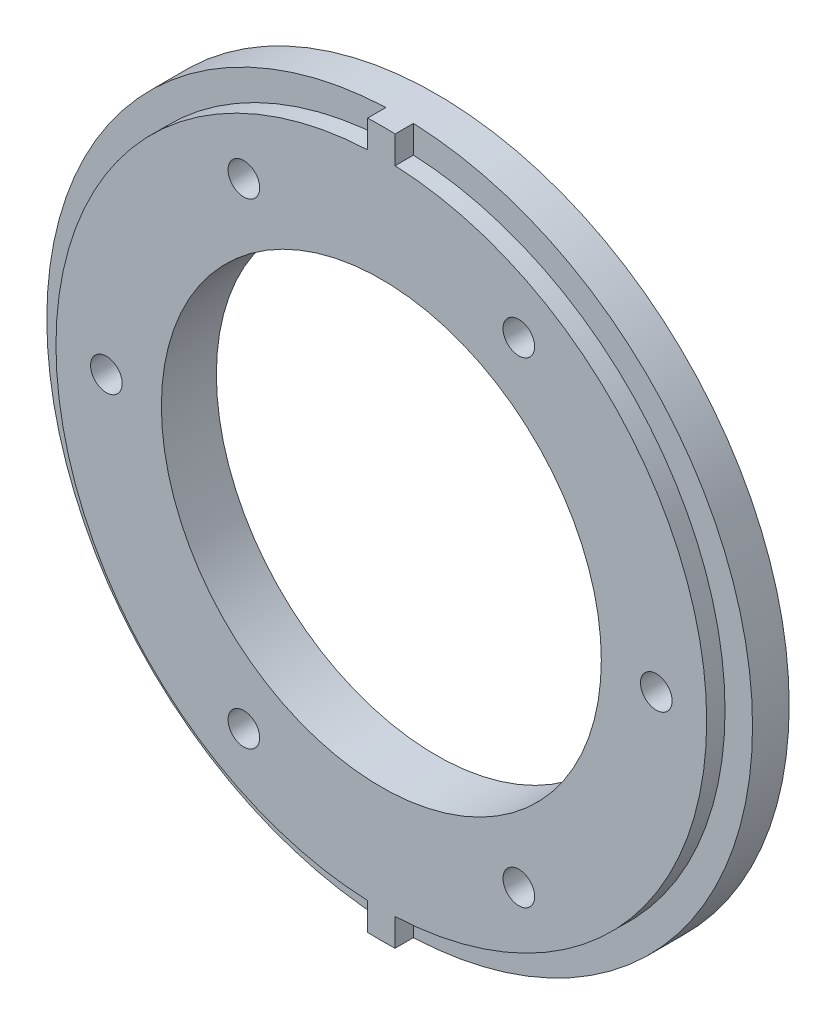
ISO-10303-21;
HEADER;
FILE_DESCRIPTION(('STEP AP214'),'2;1');
FILE_NAME('part.step','',(''),(''),'','','');
FILE_SCHEMA(('AUTOMOTIVE_DESIGN { 1 0 10303 214 1 1 1 1 }'));
ENDSEC;
DATA;
#1=APPLICATION_CONTEXT('core data for automotive mechanical design processes');
#2=APPLICATION_PROTOCOL_DEFINITION('international standard','automotive_design',2000,#1);
#3=PRODUCT_CONTEXT('',#1,'mechanical');
#4=PRODUCT('Part','Part','',(#3));
#5=PRODUCT_RELATED_PRODUCT_CATEGORY('part','',(#4));
#6=PRODUCT_DEFINITION_FORMATION('','',#4);
#7=PRODUCT_DEFINITION_CONTEXT('part definition',#1,'design');
#8=PRODUCT_DEFINITION('design','',#6,#7);
#9=PRODUCT_DEFINITION_SHAPE('','',#8);
#10=(LENGTH_UNIT() NAMED_UNIT(*) SI_UNIT(.MILLI.,.METRE.));
#11=(NAMED_UNIT(*) PLANE_ANGLE_UNIT() SI_UNIT($,.RADIAN.));
#12=(NAMED_UNIT(*) SI_UNIT($,.STERADIAN.) SOLID_ANGLE_UNIT());
#13=UNCERTAINTY_MEASURE_WITH_UNIT(LENGTH_MEASURE(1.E-05),#10,'distance_accuracy_value','');
#14=(GEOMETRIC_REPRESENTATION_CONTEXT(3) GLOBAL_UNCERTAINTY_ASSIGNED_CONTEXT((#13)) GLOBAL_UNIT_ASSIGNED_CONTEXT((#10,
#11,#12)) REPRESENTATION_CONTEXT('',''));
#15=CARTESIAN_POINT('',(0.,0.,0.));
#16=DIRECTION('',(0.,0.,1.));
#17=DIRECTION('',(1.,0.,0.));
#18=AXIS2_PLACEMENT_3D('',#15,#16,#17);
#19=CARTESIAN_POINT('',(0.,0.,4.));
#20=DIRECTION('',(0.,0.,1.));
#21=DIRECTION('',(1.,0.,0.));
#22=AXIS2_PLACEMENT_3D('',#19,#20,#21);
#23=PLANE('',#22);
#24=DIRECTION('',(0.,-1.,0.));
#25=VECTOR('',#24,1.);
#26=CARTESIAN_POINT('',(-1.50000000000178,-38.4707681233426,4.));
#27=LINE('',#26,#25);
#28=CARTESIAN_POINT('',(-1.50000000000178,-35.4682957019363,4.));
#29=VERTEX_POINT('',#28);
#30=CARTESIAN_POINT('',(-1.50000000000178,-38.4707681233426,4.));
#31=VERTEX_POINT('',#30);
#32=EDGE_CURVE('E48',#29,#31,#27,.T.);
#33=ORIENTED_EDGE('',*,*,#32,.F.);
#34=CARTESIAN_POINT('',(0.,0.,4.));
#35=DIRECTION('',(0.,0.,1.));
#36=DIRECTION('',(1.,0.,0.));
#37=AXIS2_PLACEMENT_3D('',#34,#35,#36);
#38=CIRCLE('',#37,35.5);
#39=CARTESIAN_POINT('',(-1.50000000000178,35.4682957019363,4.));
#40=VERTEX_POINT('',#39);
#41=EDGE_CURVE('E52',#40,#29,#38,.T.);
#42=ORIENTED_EDGE('',*,*,#41,.F.);
#43=DIRECTION('',(0.,-1.,0.));
#44=VECTOR('',#43,1.);
#45=CARTESIAN_POINT('',(-1.50000000000178,38.4707681233426,4.));
#46=LINE('',#45,#44);
#47=CARTESIAN_POINT('',(-1.50000000000178,38.4707681233426,4.));
#48=VERTEX_POINT('',#47);
#49=EDGE_CURVE('E205',#48,#40,#46,.T.);
#50=ORIENTED_EDGE('',*,*,#49,.F.);
#51=CARTESIAN_POINT('',(0.,0.,4.));
#52=DIRECTION('',(0.,0.,1.));
#53=DIRECTION('',(1.,0.,0.));
#54=AXIS2_PLACEMENT_3D('',#51,#52,#53);
#55=CIRCLE('',#54,38.5);
#56=EDGE_CURVE('E11',#48,#31,#55,.T.);
#57=ORIENTED_EDGE('',*,*,#56,.T.);
#58=EDGE_LOOP('',(#33,#42,#50,#57));
#59=FACE_BOUND('',#58,.T.);
#60=ADVANCED_FACE('F32',(#59),#23,.T.);
#61=DIRECTION('',(0.,1.,0.));
#62=VECTOR('',#61,1.);
#63=CARTESIAN_POINT('',(1.49999999999822,38.4707681233428,4.));
#64=LINE('',#63,#62);
#65=CARTESIAN_POINT('',(1.49999999999822,35.4682957019364,4.));
#66=VERTEX_POINT('',#65);
#67=CARTESIAN_POINT('',(1.49999999999822,38.4707681233427,4.));
#68=VERTEX_POINT('',#67);
#69=EDGE_CURVE('E180',#66,#68,#64,.T.);
#70=ORIENTED_EDGE('',*,*,#69,.F.);
#71=CARTESIAN_POINT('',(0.,0.,4.));
#72=DIRECTION('',(0.,0.,1.));
#73=DIRECTION('',(1.,0.,0.));
#74=AXIS2_PLACEMENT_3D('',#71,#72,#73);
#75=CIRCLE('',#74,35.5);
#76=CARTESIAN_POINT('',(1.49999999999822,-35.4682957019364,4.));
#77=VERTEX_POINT('',#76);
#78=EDGE_CURVE('E177',#77,#66,#75,.T.);
#79=ORIENTED_EDGE('',*,*,#78,.F.);
#80=DIRECTION('',(0.,1.,0.));
#81=VECTOR('',#80,1.);
#82=CARTESIAN_POINT('',(1.49999999999822,-38.4707681233428,4.));
#83=LINE('',#82,#81);
#84=CARTESIAN_POINT('',(1.49999999999822,-38.4707681233427,4.));
#85=VERTEX_POINT('',#84);
#86=EDGE_CURVE('E176',#85,#77,#83,.T.);
#87=ORIENTED_EDGE('',*,*,#86,.F.);
#88=EDGE_CURVE('E41',#85,#68,#55,.T.);
#89=ORIENTED_EDGE('',*,*,#88,.T.);
#90=EDGE_LOOP('',(#70,#79,#87,#89));
#91=FACE_BOUND('',#90,.T.);
#92=ADVANCED_FACE('F226',(#91),#23,.T.);
#93=CARTESIAN_POINT('',(0.,0.,0.));
#94=DIRECTION('',(0.,0.,1.));
#95=DIRECTION('',(1.,0.,0.));
#96=AXIS2_PLACEMENT_3D('',#93,#94,#95);
#97=PLANE('',#96);
#98=CARTESIAN_POINT('',(-14.9999999999948,25.9807621135328,0.));
#99=DIRECTION('',(0.,0.,1.));
#100=DIRECTION('',(1.,0.,0.));
#101=AXIS2_PLACEMENT_3D('',#98,#99,#100);
#102=CIRCLE('',#101,1.725);
#103=CARTESIAN_POINT('',(-13.2749999999948,25.9807621135328,0.));
#104=VERTEX_POINT('',#103);
#105=EDGE_CURVE('E125',#104,#104,#102,.T.);
#106=ORIENTED_EDGE('',*,*,#105,.T.);
#107=EDGE_LOOP('',(#106));
#108=FACE_BOUND('',#107,.T.);
#109=CARTESIAN_POINT('',(29.9999999999971,0.,0.));
#110=DIRECTION('',(0.,0.,1.));
#111=DIRECTION('',(1.,0.,0.));
#112=AXIS2_PLACEMENT_3D('',#109,#110,#111);
#113=CIRCLE('',#112,1.725);
#114=CARTESIAN_POINT('',(31.7249999999971,0.,0.));
#115=VERTEX_POINT('',#114);
#116=EDGE_CURVE('E158',#115,#115,#113,.T.);
#117=ORIENTED_EDGE('',*,*,#116,.T.);
#118=EDGE_LOOP('',(#117));
#119=FACE_BOUND('',#118,.T.);
#120=CARTESIAN_POINT('',(14.9999999999948,25.9807621135328,0.));
#121=DIRECTION('',(0.,0.,1.));
#122=DIRECTION('',(-1.,0.,0.));
#123=AXIS2_PLACEMENT_3D('',#120,#121,#122);
#124=CIRCLE('',#123,1.725);
#125=CARTESIAN_POINT('',(13.2749999999948,25.9807621135328,0.));
#126=VERTEX_POINT('',#125);
#127=EDGE_CURVE('E164',#126,#126,#124,.T.);
#128=ORIENTED_EDGE('',*,*,#127,.T.);
#129=EDGE_LOOP('',(#128));
#130=FACE_BOUND('',#129,.T.);
#131=CARTESIAN_POINT('',(0.,0.,0.));
#132=DIRECTION('',(0.,0.,1.));
#133=DIRECTION('',(1.,0.,0.));
#134=AXIS2_PLACEMENT_3D('',#131,#132,#133);
#135=CIRCLE('',#134,38.5);
#136=CARTESIAN_POINT('',(38.5,0.,0.));
#137=VERTEX_POINT('',#136);
#138=EDGE_CURVE('E170',#137,#137,#135,.T.);
#139=ORIENTED_EDGE('',*,*,#138,.F.);
#140=EDGE_LOOP('',(#139));
#141=FACE_BOUND('',#140,.T.);
#142=CARTESIAN_POINT('',(14.9999999999948,-25.9807621135328,0.));
#143=DIRECTION('',(0.,0.,1.));
#144=DIRECTION('',(-1.,0.,0.));
#145=AXIS2_PLACEMENT_3D('',#142,#143,#144);
#146=CIRCLE('',#145,1.725);
#147=CARTESIAN_POINT('',(13.2749999999948,-25.9807621135328,0.));
#148=VERTEX_POINT('',#147);
#149=EDGE_CURVE('E167',#148,#148,#146,.T.);
#150=ORIENTED_EDGE('',*,*,#149,.T.);
#151=EDGE_LOOP('',(#150));
#152=FACE_BOUND('',#151,.T.);
#153=CARTESIAN_POINT('',(-29.9999999999971,0.,0.));
#154=DIRECTION('',(0.,0.,1.));
#155=DIRECTION('',(1.,0.,0.));
#156=AXIS2_PLACEMENT_3D('',#153,#154,#155);
#157=CIRCLE('',#156,1.725);
#158=CARTESIAN_POINT('',(-28.2749999999971,0.,0.));
#159=VERTEX_POINT('',#158);
#160=EDGE_CURVE('E161',#159,#159,#157,.T.);
#161=ORIENTED_EDGE('',*,*,#160,.T.);
#162=EDGE_LOOP('',(#161));
#163=FACE_BOUND('',#162,.T.);
#164=CARTESIAN_POINT('',(-14.9999999999948,-25.9807621135328,0.));
#165=DIRECTION('',(0.,0.,1.));
#166=DIRECTION('',(1.,0.,0.));
#167=AXIS2_PLACEMENT_3D('',#164,#165,#166);
#168=CIRCLE('',#167,1.725);
#169=CARTESIAN_POINT('',(-13.2749999999948,-25.9807621135328,0.));
#170=VERTEX_POINT('',#169);
#171=EDGE_CURVE('E155',#170,#170,#168,.T.);
#172=ORIENTED_EDGE('',*,*,#171,.T.);
#173=EDGE_LOOP('',(#172));
#174=FACE_BOUND('',#173,.T.);
#175=CARTESIAN_POINT('',(0.,0.,0.));
#176=DIRECTION('',(0.,0.,1.));
#177=DIRECTION('',(1.,0.,0.));
#178=AXIS2_PLACEMENT_3D('',#175,#176,#177);
#179=CIRCLE('',#178,24.);
#180=CARTESIAN_POINT('',(24.,0.,0.));
#181=VERTEX_POINT('',#180);
#182=EDGE_CURVE('E122',#181,#181,#179,.T.);
#183=ORIENTED_EDGE('',*,*,#182,.T.);
#184=EDGE_LOOP('',(#183));
#185=FACE_BOUND('',#184,.T.);
#186=ADVANCED_FACE('F231',(#108,#119,#130,#141,#152,#163,#174,#185),#97,.F.);
#187=CARTESIAN_POINT('',(0.,0.,4.));
#188=DIRECTION('',(0.,0.,-1.));
#189=DIRECTION('',(-1.,0.,0.));
#190=AXIS2_PLACEMENT_3D('',#187,#188,#189);
#191=CYLINDRICAL_SURFACE('',#190,38.5);
#192=ORIENTED_EDGE('',*,*,#56,.F.);
#193=DIRECTION('',(0.,0.,-1.));
#194=VECTOR('',#193,1.);
#195=CARTESIAN_POINT('',(-1.50000000000178,38.4707681233426,6.));
#196=LINE('',#195,#194);
#197=CARTESIAN_POINT('',(-1.50000000000178,38.4707681233426,6.));
#198=VERTEX_POINT('',#197);
#199=EDGE_CURVE('E149',#198,#48,#196,.T.);
#200=ORIENTED_EDGE('',*,*,#199,.F.);
#201=CARTESIAN_POINT('',(0.,0.,6.));
#202=DIRECTION('',(0.,0.,1.));
#203=DIRECTION('',(1.,0.,0.));
#204=AXIS2_PLACEMENT_3D('',#201,#202,#203);
#205=CIRCLE('',#204,38.5);
#206=CARTESIAN_POINT('',(1.49999999999822,38.4707681233428,6.));
#207=VERTEX_POINT('',#206);
#208=EDGE_CURVE('E195',#207,#198,#205,.T.);
#209=ORIENTED_EDGE('',*,*,#208,.F.);
#210=DIRECTION('',(0.,0.,-1.));
#211=VECTOR('',#210,1.);
#212=CARTESIAN_POINT('',(1.49999999999822,38.4707681233428,6.));
#213=LINE('',#212,#211);
#214=EDGE_CURVE('E151',#207,#68,#213,.T.);
#215=ORIENTED_EDGE('',*,*,#214,.T.);
#216=ORIENTED_EDGE('',*,*,#88,.F.);
#217=DIRECTION('',(0.,0.,-1.));
#218=VECTOR('',#217,1.);
#219=CARTESIAN_POINT('',(1.49999999999822,-38.4707681233428,6.));
#220=LINE('',#219,#218);
#221=CARTESIAN_POINT('',(1.49999999999822,-38.4707681233428,6.));
#222=VERTEX_POINT('',#221);
#223=EDGE_CURVE('E101',#222,#85,#220,.T.);
#224=ORIENTED_EDGE('',*,*,#223,.F.);
#225=CARTESIAN_POINT('',(0.,0.,6.));
#226=DIRECTION('',(0.,0.,1.));
#227=DIRECTION('',(-1.,0.,0.));
#228=AXIS2_PLACEMENT_3D('',#225,#226,#227);
#229=CIRCLE('',#228,38.5);
#230=CARTESIAN_POINT('',(-1.50000000000178,-38.4707681233426,6.));
#231=VERTEX_POINT('',#230);
#232=EDGE_CURVE('E107',#231,#222,#229,.T.);
#233=ORIENTED_EDGE('',*,*,#232,.F.);
#234=DIRECTION('',(0.,0.,-1.));
#235=VECTOR('',#234,1.);
#236=CARTESIAN_POINT('',(-1.50000000000178,-38.4707681233426,6.));
#237=LINE('',#236,#235);
#238=EDGE_CURVE('E137',#231,#31,#237,.T.);
#239=ORIENTED_EDGE('',*,*,#238,.T.);
#240=EDGE_LOOP('',(#192,#200,#209,#215,#216,#224,#233,#239));
#241=FACE_BOUND('',#240,.T.);
#242=ORIENTED_EDGE('',*,*,#138,.T.);
#243=EDGE_LOOP('',(#242));
#244=FACE_BOUND('',#243,.T.);
#245=ADVANCED_FACE('F34',(#241,#244),#191,.T.);
#246=CARTESIAN_POINT('',(14.9999999999948,-25.9807621135328,4.));
#247=DIRECTION('',(0.,0.,-1.));
#248=DIRECTION('',(-1.,0.,0.));
#249=AXIS2_PLACEMENT_3D('',#246,#247,#248);
#250=CYLINDRICAL_SURFACE('',#249,1.725);
#251=ORIENTED_EDGE('',*,*,#149,.F.);
#252=EDGE_LOOP('',(#251));
#253=FACE_BOUND('',#252,.T.);
#254=CARTESIAN_POINT('',(14.9999999999948,-25.9807621135328,6.));
#255=DIRECTION('',(0.,0.,1.));
#256=DIRECTION('',(1.,0.,0.));
#257=AXIS2_PLACEMENT_3D('',#254,#255,#256);
#258=CIRCLE('',#257,1.725);
#259=CARTESIAN_POINT('',(16.7249999999948,-25.9807621135328,6.));
#260=VERTEX_POINT('',#259);
#261=EDGE_CURVE('E296',#260,#260,#258,.T.);
#262=ORIENTED_EDGE('',*,*,#261,.T.);
#263=EDGE_LOOP('',(#262));
#264=FACE_BOUND('',#263,.T.);
#265=ADVANCED_FACE('F234',(#253,#264),#250,.F.);
#266=CARTESIAN_POINT('',(14.9999999999948,25.9807621135328,4.));
#267=DIRECTION('',(0.,0.,-1.));
#268=DIRECTION('',(-1.,0.,0.));
#269=AXIS2_PLACEMENT_3D('',#266,#267,#268);
#270=CYLINDRICAL_SURFACE('',#269,1.725);
#271=ORIENTED_EDGE('',*,*,#127,.F.);
#272=EDGE_LOOP('',(#271));
#273=FACE_BOUND('',#272,.T.);
#274=CARTESIAN_POINT('',(14.9999999999948,25.9807621135328,6.));
#275=DIRECTION('',(0.,0.,1.));
#276=DIRECTION('',(1.,0.,0.));
#277=AXIS2_PLACEMENT_3D('',#274,#275,#276);
#278=CIRCLE('',#277,1.725);
#279=CARTESIAN_POINT('',(16.7249999999948,25.9807621135328,6.));
#280=VERTEX_POINT('',#279);
#281=EDGE_CURVE('E188',#280,#280,#278,.T.);
#282=ORIENTED_EDGE('',*,*,#281,.T.);
#283=EDGE_LOOP('',(#282));
#284=FACE_BOUND('',#283,.T.);
#285=ADVANCED_FACE('F282',(#273,#284),#270,.F.);
#286=CARTESIAN_POINT('',(-29.9999999999971,0.,4.));
#287=DIRECTION('',(0.,0.,-1.));
#288=DIRECTION('',(-1.,0.,0.));
#289=AXIS2_PLACEMENT_3D('',#286,#287,#288);
#290=CYLINDRICAL_SURFACE('',#289,1.725);
#291=ORIENTED_EDGE('',*,*,#160,.F.);
#292=EDGE_LOOP('',(#291));
#293=FACE_BOUND('',#292,.T.);
#294=CARTESIAN_POINT('',(-29.9999999999971,0.,6.));
#295=DIRECTION('',(0.,0.,1.));
#296=DIRECTION('',(1.,0.,0.));
#297=AXIS2_PLACEMENT_3D('',#294,#295,#296);
#298=CIRCLE('',#297,1.725);
#299=CARTESIAN_POINT('',(-28.2749999999971,0.,6.));
#300=VERTEX_POINT('',#299);
#301=EDGE_CURVE('E304',#300,#300,#298,.T.);
#302=ORIENTED_EDGE('',*,*,#301,.T.);
#303=EDGE_LOOP('',(#302));
#304=FACE_BOUND('',#303,.T.);
#305=ADVANCED_FACE('F279',(#293,#304),#290,.F.);
#306=CARTESIAN_POINT('',(29.9999999999971,0.,4.));
#307=DIRECTION('',(0.,0.,-1.));
#308=DIRECTION('',(-1.,0.,0.));
#309=AXIS2_PLACEMENT_3D('',#306,#307,#308);
#310=CYLINDRICAL_SURFACE('',#309,1.725);
#311=ORIENTED_EDGE('',*,*,#116,.F.);
#312=EDGE_LOOP('',(#311));
#313=FACE_BOUND('',#312,.T.);
#314=CARTESIAN_POINT('',(29.9999999999971,0.,6.));
#315=DIRECTION('',(0.,0.,1.));
#316=DIRECTION('',(1.,0.,0.));
#317=AXIS2_PLACEMENT_3D('',#314,#315,#316);
#318=CIRCLE('',#317,1.725);
#319=CARTESIAN_POINT('',(31.7249999999971,0.,6.));
#320=VERTEX_POINT('',#319);
#321=EDGE_CURVE('E294',#320,#320,#318,.T.);
#322=ORIENTED_EDGE('',*,*,#321,.T.);
#323=EDGE_LOOP('',(#322));
#324=FACE_BOUND('',#323,.T.);
#325=ADVANCED_FACE('F275',(#313,#324),#310,.F.);
#326=CARTESIAN_POINT('',(-14.9999999999948,-25.9807621135328,4.));
#327=DIRECTION('',(0.,0.,-1.));
#328=DIRECTION('',(-1.,0.,0.));
#329=AXIS2_PLACEMENT_3D('',#326,#327,#328);
#330=CYLINDRICAL_SURFACE('',#329,1.725);
#331=ORIENTED_EDGE('',*,*,#171,.F.);
#332=EDGE_LOOP('',(#331));
#333=FACE_BOUND('',#332,.T.);
#334=CARTESIAN_POINT('',(-14.9999999999948,-25.9807621135328,6.));
#335=DIRECTION('',(0.,0.,1.));
#336=DIRECTION('',(1.,0.,0.));
#337=AXIS2_PLACEMENT_3D('',#334,#335,#336);
#338=CIRCLE('',#337,1.725);
#339=CARTESIAN_POINT('',(-13.2749999999948,-25.9807621135328,6.));
#340=VERTEX_POINT('',#339);
#341=EDGE_CURVE('E301',#340,#340,#338,.T.);
#342=ORIENTED_EDGE('',*,*,#341,.T.);
#343=EDGE_LOOP('',(#342));
#344=FACE_BOUND('',#343,.T.);
#345=ADVANCED_FACE('F267',(#333,#344),#330,.F.);
#346=CARTESIAN_POINT('',(-14.9999999999948,25.9807621135328,4.));
#347=DIRECTION('',(0.,0.,-1.));
#348=DIRECTION('',(-1.,0.,0.));
#349=AXIS2_PLACEMENT_3D('',#346,#347,#348);
#350=CYLINDRICAL_SURFACE('',#349,1.725);
#351=ORIENTED_EDGE('',*,*,#105,.F.);
#352=EDGE_LOOP('',(#351));
#353=FACE_BOUND('',#352,.T.);
#354=CARTESIAN_POINT('',(-14.9999999999948,25.9807621135328,6.));
#355=DIRECTION('',(0.,0.,1.));
#356=DIRECTION('',(1.,0.,0.));
#357=AXIS2_PLACEMENT_3D('',#354,#355,#356);
#358=CIRCLE('',#357,1.725);
#359=CARTESIAN_POINT('',(-13.2749999999948,25.9807621135328,6.));
#360=VERTEX_POINT('',#359);
#361=EDGE_CURVE('E183',#360,#360,#358,.T.);
#362=ORIENTED_EDGE('',*,*,#361,.T.);
#363=EDGE_LOOP('',(#362));
#364=FACE_BOUND('',#363,.T.);
#365=ADVANCED_FACE('F259',(#353,#364),#350,.F.);
#366=CARTESIAN_POINT('',(0.,0.,4.));
#367=DIRECTION('',(0.,0.,-1.));
#368=DIRECTION('',(-1.,0.,0.));
#369=AXIS2_PLACEMENT_3D('',#366,#367,#368);
#370=CYLINDRICAL_SURFACE('',#369,24.);
#371=ORIENTED_EDGE('',*,*,#182,.F.);
#372=EDGE_LOOP('',(#371));
#373=FACE_BOUND('',#372,.T.);
#374=CARTESIAN_POINT('',(0.,0.,6.));
#375=DIRECTION('',(0.,0.,1.));
#376=DIRECTION('',(1.,0.,0.));
#377=AXIS2_PLACEMENT_3D('',#374,#375,#376);
#378=CIRCLE('',#377,24.);
#379=CARTESIAN_POINT('',(24.,0.,6.));
#380=VERTEX_POINT('',#379);
#381=EDGE_CURVE('E178',#380,#380,#378,.T.);
#382=ORIENTED_EDGE('',*,*,#381,.T.);
#383=EDGE_LOOP('',(#382));
#384=FACE_BOUND('',#383,.T.);
#385=ADVANCED_FACE('F257',(#373,#384),#370,.F.);
#386=CARTESIAN_POINT('',(0.,0.,6.));
#387=DIRECTION('',(0.,0.,-1.));
#388=DIRECTION('',(-1.,0.,0.));
#389=AXIS2_PLACEMENT_3D('',#386,#387,#388);
#390=PLANE('',#389);
#391=ORIENTED_EDGE('',*,*,#341,.F.);
#392=EDGE_LOOP('',(#391));
#393=FACE_BOUND('',#392,.T.);
#394=ORIENTED_EDGE('',*,*,#321,.F.);
#395=EDGE_LOOP('',(#394));
#396=FACE_BOUND('',#395,.T.);
#397=ORIENTED_EDGE('',*,*,#361,.F.);
#398=EDGE_LOOP('',(#397));
#399=FACE_BOUND('',#398,.T.);
#400=ORIENTED_EDGE('',*,*,#232,.T.);
#401=DIRECTION('',(0.,1.,0.));
#402=VECTOR('',#401,1.);
#403=CARTESIAN_POINT('',(1.49999999999822,-38.4707681233428,6.));
#404=LINE('',#403,#402);
#405=CARTESIAN_POINT('',(1.49999999999822,-35.4682957019364,6.));
#406=VERTEX_POINT('',#405);
#407=EDGE_CURVE('E96',#222,#406,#404,.T.);
#408=ORIENTED_EDGE('',*,*,#407,.T.);
#409=CARTESIAN_POINT('',(0.,0.,6.));
#410=DIRECTION('',(0.,0.,1.));
#411=DIRECTION('',(1.,0.,0.));
#412=AXIS2_PLACEMENT_3D('',#409,#410,#411);
#413=CIRCLE('',#412,35.5);
#414=CARTESIAN_POINT('',(1.49999999999822,35.4682957019364,6.));
#415=VERTEX_POINT('',#414);
#416=EDGE_CURVE('E106',#406,#415,#413,.T.);
#417=ORIENTED_EDGE('',*,*,#416,.T.);
#418=DIRECTION('',(0.,1.,0.));
#419=VECTOR('',#418,1.);
#420=CARTESIAN_POINT('',(1.49999999999822,38.4707681233428,6.));
#421=LINE('',#420,#419);
#422=EDGE_CURVE('E193',#415,#207,#421,.T.);
#423=ORIENTED_EDGE('',*,*,#422,.T.);
#424=ORIENTED_EDGE('',*,*,#208,.T.);
#425=DIRECTION('',(0.,-1.,0.));
#426=VECTOR('',#425,1.);
#427=CARTESIAN_POINT('',(-1.50000000000178,38.4707681233426,6.));
#428=LINE('',#427,#426);
#429=CARTESIAN_POINT('',(-1.50000000000178,35.4682957019363,6.));
#430=VERTEX_POINT('',#429);
#431=EDGE_CURVE('E197',#198,#430,#428,.T.);
#432=ORIENTED_EDGE('',*,*,#431,.T.);
#433=CARTESIAN_POINT('',(0.,0.,6.));
#434=DIRECTION('',(0.,0.,1.));
#435=DIRECTION('',(1.,0.,0.));
#436=AXIS2_PLACEMENT_3D('',#433,#434,#435);
#437=CIRCLE('',#436,35.5);
#438=CARTESIAN_POINT('',(-1.50000000000178,-35.4682957019363,6.));
#439=VERTEX_POINT('',#438);
#440=EDGE_CURVE('E199',#430,#439,#437,.T.);
#441=ORIENTED_EDGE('',*,*,#440,.T.);
#442=DIRECTION('',(0.,-1.,0.));
#443=VECTOR('',#442,1.);
#444=CARTESIAN_POINT('',(-1.50000000000178,-38.4707681233426,6.));
#445=LINE('',#444,#443);
#446=EDGE_CURVE('E113',#439,#231,#445,.T.);
#447=ORIENTED_EDGE('',*,*,#446,.T.);
#448=EDGE_LOOP('',(#400,#408,#417,#423,#424,#432,#441,#447));
#449=FACE_BOUND('',#448,.T.);
#450=ORIENTED_EDGE('',*,*,#381,.F.);
#451=EDGE_LOOP('',(#450));
#452=FACE_BOUND('',#451,.T.);
#453=ORIENTED_EDGE('',*,*,#281,.F.);
#454=EDGE_LOOP('',(#453));
#455=FACE_BOUND('',#454,.T.);
#456=ORIENTED_EDGE('',*,*,#261,.F.);
#457=EDGE_LOOP('',(#456));
#458=FACE_BOUND('',#457,.T.);
#459=ORIENTED_EDGE('',*,*,#301,.F.);
#460=EDGE_LOOP('',(#459));
#461=FACE_BOUND('',#460,.T.);
#462=ADVANCED_FACE('F110',(#393,#396,#399,#449,#452,#455,#458,#461),#390,.F.);
#463=CARTESIAN_POINT('',(1.49999999999822,-38.4707681233428,6.));
#464=DIRECTION('',(-1.,0.,0.));
#465=DIRECTION('',(0.,0.,1.));
#466=AXIS2_PLACEMENT_3D('',#463,#464,#465);
#467=PLANE('',#466);
#468=ORIENTED_EDGE('',*,*,#86,.T.);
#469=DIRECTION('',(0.,0.,-1.));
#470=VECTOR('',#469,1.);
#471=CARTESIAN_POINT('',(1.49999999999822,-35.4682957019364,6.));
#472=LINE('',#471,#470);
#473=EDGE_CURVE('E103',#406,#77,#472,.T.);
#474=ORIENTED_EDGE('',*,*,#473,.F.);
#475=ORIENTED_EDGE('',*,*,#407,.F.);
#476=ORIENTED_EDGE('',*,*,#223,.T.);
#477=EDGE_LOOP('',(#468,#474,#475,#476));
#478=FACE_BOUND('',#477,.T.);
#479=ADVANCED_FACE('F99',(#478),#467,.F.);
#480=CARTESIAN_POINT('',(0.,0.,6.));
#481=DIRECTION('',(0.,0.,-1.));
#482=DIRECTION('',(-1.,0.,0.));
#483=AXIS2_PLACEMENT_3D('',#480,#481,#482);
#484=CYLINDRICAL_SURFACE('',#483,35.5);
#485=ORIENTED_EDGE('',*,*,#78,.T.);
#486=DIRECTION('',(0.,0.,-1.));
#487=VECTOR('',#486,1.);
#488=CARTESIAN_POINT('',(1.49999999999822,35.4682957019364,6.));
#489=LINE('',#488,#487);
#490=EDGE_CURVE('E127',#415,#66,#489,.T.);
#491=ORIENTED_EDGE('',*,*,#490,.F.);
#492=ORIENTED_EDGE('',*,*,#416,.F.);
#493=ORIENTED_EDGE('',*,*,#473,.T.);
#494=EDGE_LOOP('',(#485,#491,#492,#493));
#495=FACE_BOUND('',#494,.T.);
#496=ADVANCED_FACE('F407',(#495),#484,.T.);
#497=CARTESIAN_POINT('',(1.49999999999822,38.4707681233428,6.));
#498=DIRECTION('',(-1.,0.,0.));
#499=DIRECTION('',(0.,0.,1.));
#500=AXIS2_PLACEMENT_3D('',#497,#498,#499);
#501=PLANE('',#500);
#502=ORIENTED_EDGE('',*,*,#69,.T.);
#503=ORIENTED_EDGE('',*,*,#214,.F.);
#504=ORIENTED_EDGE('',*,*,#422,.F.);
#505=ORIENTED_EDGE('',*,*,#490,.T.);
#506=EDGE_LOOP('',(#502,#503,#504,#505));
#507=FACE_BOUND('',#506,.T.);
#508=ADVANCED_FACE('F414',(#507),#501,.F.);
#509=CARTESIAN_POINT('',(-1.50000000000178,38.4707681233426,6.));
#510=DIRECTION('',(1.,0.,0.));
#511=DIRECTION('',(0.,0.,-1.));
#512=AXIS2_PLACEMENT_3D('',#509,#510,#511);
#513=PLANE('',#512);
#514=ORIENTED_EDGE('',*,*,#49,.T.);
#515=DIRECTION('',(0.,0.,-1.));
#516=VECTOR('',#515,1.);
#517=CARTESIAN_POINT('',(-1.50000000000178,35.4682957019363,6.));
#518=LINE('',#517,#516);
#519=EDGE_CURVE('E146',#430,#40,#518,.T.);
#520=ORIENTED_EDGE('',*,*,#519,.F.);
#521=ORIENTED_EDGE('',*,*,#431,.F.);
#522=ORIENTED_EDGE('',*,*,#199,.T.);
#523=EDGE_LOOP('',(#514,#520,#521,#522));
#524=FACE_BOUND('',#523,.T.);
#525=ADVANCED_FACE('F422',(#524),#513,.F.);
#526=CARTESIAN_POINT('',(0.,0.,6.));
#527=DIRECTION('',(0.,0.,-1.));
#528=DIRECTION('',(-1.,0.,0.));
#529=AXIS2_PLACEMENT_3D('',#526,#527,#528);
#530=CYLINDRICAL_SURFACE('',#529,35.5);
#531=ORIENTED_EDGE('',*,*,#41,.T.);
#532=DIRECTION('',(0.,0.,-1.));
#533=VECTOR('',#532,1.);
#534=CARTESIAN_POINT('',(-1.50000000000178,-35.4682957019363,6.));
#535=LINE('',#534,#533);
#536=EDGE_CURVE('E143',#439,#29,#535,.T.);
#537=ORIENTED_EDGE('',*,*,#536,.F.);
#538=ORIENTED_EDGE('',*,*,#440,.F.);
#539=ORIENTED_EDGE('',*,*,#519,.T.);
#540=EDGE_LOOP('',(#531,#537,#538,#539));
#541=FACE_BOUND('',#540,.T.);
#542=ADVANCED_FACE('F221',(#541),#530,.T.);
#543=CARTESIAN_POINT('',(-1.50000000000178,-38.4707681233426,6.));
#544=DIRECTION('',(1.,0.,0.));
#545=DIRECTION('',(0.,0.,-1.));
#546=AXIS2_PLACEMENT_3D('',#543,#544,#545);
#547=PLANE('',#546);
#548=ORIENTED_EDGE('',*,*,#32,.T.);
#549=ORIENTED_EDGE('',*,*,#238,.F.);
#550=ORIENTED_EDGE('',*,*,#446,.F.);
#551=ORIENTED_EDGE('',*,*,#536,.T.);
#552=EDGE_LOOP('',(#548,#549,#550,#551));
#553=FACE_BOUND('',#552,.T.);
#554=ADVANCED_FACE('F224',(#553),#547,.F.);
#555=CLOSED_SHELL('',(#60,#92,#186,#245,#265,#285,#305,#325,#345,#365,#385,#462,#479,#496,#508,
#525,#542,#554));
#556=MANIFOLD_SOLID_BREP('B2',#555);
#557=ADVANCED_BREP_SHAPE_REPRESENTATION('',(#18,#556),#14);
#558=SHAPE_DEFINITION_REPRESENTATION(#9,#557);
ENDSEC;
END-ISO-10303-21;
